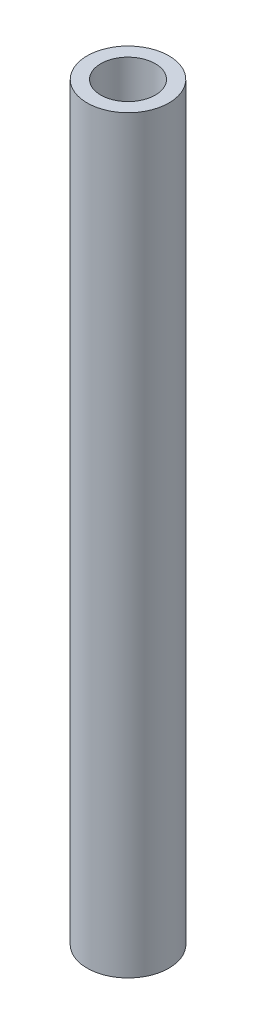
ISO-10303-21;
HEADER;
FILE_DESCRIPTION(('STEP AP214'),'2;1');
FILE_NAME('part.step','',(''),(''),'','','');
FILE_SCHEMA(('AUTOMOTIVE_DESIGN { 1 0 10303 214 1 1 1 1 }'));
ENDSEC;
DATA;
#1=APPLICATION_CONTEXT('core data for automotive mechanical design processes');
#2=APPLICATION_PROTOCOL_DEFINITION('international standard','automotive_design',2000,#1);
#3=PRODUCT_CONTEXT('',#1,'mechanical');
#4=PRODUCT('Part','Part','',(#3));
#5=PRODUCT_RELATED_PRODUCT_CATEGORY('part','',(#4));
#6=PRODUCT_DEFINITION_FORMATION('','',#4);
#7=PRODUCT_DEFINITION_CONTEXT('part definition',#1,'design');
#8=PRODUCT_DEFINITION('design','',#6,#7);
#9=PRODUCT_DEFINITION_SHAPE('','',#8);
#10=(LENGTH_UNIT() NAMED_UNIT(*) SI_UNIT(.MILLI.,.METRE.));
#11=(NAMED_UNIT(*) PLANE_ANGLE_UNIT() SI_UNIT($,.RADIAN.));
#12=(NAMED_UNIT(*) SI_UNIT($,.STERADIAN.) SOLID_ANGLE_UNIT());
#13=UNCERTAINTY_MEASURE_WITH_UNIT(LENGTH_MEASURE(1.E-05),#10,'distance_accuracy_value','');
#14=(GEOMETRIC_REPRESENTATION_CONTEXT(3) GLOBAL_UNCERTAINTY_ASSIGNED_CONTEXT((#13)) GLOBAL_UNIT_ASSIGNED_CONTEXT((#10,
#11,#12)) REPRESENTATION_CONTEXT('',''));
#15=CARTESIAN_POINT('',(0.,0.,0.));
#16=DIRECTION('',(0.,0.,1.));
#17=DIRECTION('',(1.,0.,0.));
#18=AXIS2_PLACEMENT_3D('',#15,#16,#17);
#19=CARTESIAN_POINT('',(0.,-27.5,0.));
#20=DIRECTION('',(0.,-1.,0.));
#21=DIRECTION('',(1.,0.,0.));
#22=AXIS2_PLACEMENT_3D('',#19,#20,#21);
#23=PLANE('',#22);
#24=CARTESIAN_POINT('',(0.,-27.5,0.));
#25=DIRECTION('',(0.,-1.,0.));
#26=DIRECTION('',(1.,0.,0.));
#27=AXIS2_PLACEMENT_3D('',#24,#25,#26);
#28=CIRCLE('',#27,3.00000000000001);
#29=CARTESIAN_POINT('',(3.00000000000001,-27.5,0.));
#30=VERTEX_POINT('',#29);
#31=EDGE_CURVE('E48',#30,#30,#28,.T.);
#32=ORIENTED_EDGE('',*,*,#31,.T.);
#33=EDGE_LOOP('',(#32));
#34=FACE_BOUND('',#33,.T.);
#35=CARTESIAN_POINT('',(0.,-27.5,0.));
#36=DIRECTION('',(0.,-1.,0.));
#37=DIRECTION('',(1.,0.,0.));
#38=AXIS2_PLACEMENT_3D('',#35,#36,#37);
#39=CIRCLE('',#38,2.00000000000001);
#40=CARTESIAN_POINT('',(2.00000000000001,-27.5,0.));
#41=VERTEX_POINT('',#40);
#42=EDGE_CURVE('E10',#41,#41,#39,.T.);
#43=ORIENTED_EDGE('',*,*,#42,.F.);
#44=EDGE_LOOP('',(#43));
#45=FACE_BOUND('',#44,.T.);
#46=ADVANCED_FACE('F34',(#34,#45),#23,.T.);
#47=CARTESIAN_POINT('',(0.,-0.72021608418962,0.));
#48=DIRECTION('',(0.,-1.,0.));
#49=DIRECTION('',(1.,0.,0.));
#50=AXIS2_PLACEMENT_3D('',#47,#48,#49);
#51=CYLINDRICAL_SURFACE('',#50,2.);
#52=CARTESIAN_POINT('',(0.,27.5,0.));
#53=DIRECTION('',(0.,-1.,0.));
#54=DIRECTION('',(1.,0.,0.));
#55=AXIS2_PLACEMENT_3D('',#52,#53,#54);
#56=CIRCLE('',#55,2.);
#57=CARTESIAN_POINT('',(1.99999999999999,27.5,0.));
#58=VERTEX_POINT('',#57);
#59=EDGE_CURVE('E40',#58,#58,#56,.T.);
#60=ORIENTED_EDGE('',*,*,#59,.F.);
#61=EDGE_LOOP('',(#60));
#62=FACE_BOUND('',#61,.T.);
#63=ORIENTED_EDGE('',*,*,#42,.T.);
#64=EDGE_LOOP('',(#63));
#65=FACE_BOUND('',#64,.T.);
#66=ADVANCED_FACE('F64',(#62,#65),#51,.F.);
#67=CARTESIAN_POINT('',(0.,27.5,0.));
#68=DIRECTION('',(0.,-1.,0.));
#69=DIRECTION('',(1.,0.,0.));
#70=AXIS2_PLACEMENT_3D('',#67,#68,#69);
#71=PLANE('',#70);
#72=CARTESIAN_POINT('',(0.,27.5,0.));
#73=DIRECTION('',(0.,-1.,0.));
#74=DIRECTION('',(1.,0.,0.));
#75=AXIS2_PLACEMENT_3D('',#72,#73,#74);
#76=CIRCLE('',#75,3.);
#77=CARTESIAN_POINT('',(2.99999999999999,27.5,0.));
#78=VERTEX_POINT('',#77);
#79=EDGE_CURVE('E44',#78,#78,#76,.T.);
#80=ORIENTED_EDGE('',*,*,#79,.F.);
#81=EDGE_LOOP('',(#80));
#82=FACE_BOUND('',#81,.T.);
#83=ORIENTED_EDGE('',*,*,#59,.T.);
#84=EDGE_LOOP('',(#83));
#85=FACE_BOUND('',#84,.T.);
#86=ADVANCED_FACE('F58',(#82,#85),#71,.F.);
#87=CARTESIAN_POINT('',(0.,-0.72021608418962,0.));
#88=DIRECTION('',(0.,-1.,0.));
#89=DIRECTION('',(1.,0.,0.));
#90=AXIS2_PLACEMENT_3D('',#87,#88,#89);
#91=CYLINDRICAL_SURFACE('',#90,3.);
#92=ORIENTED_EDGE('',*,*,#79,.T.);
#93=EDGE_LOOP('',(#92));
#94=FACE_BOUND('',#93,.T.);
#95=ORIENTED_EDGE('',*,*,#31,.F.);
#96=EDGE_LOOP('',(#95));
#97=FACE_BOUND('',#96,.T.);
#98=ADVANCED_FACE('F56',(#94,#97),#91,.T.);
#99=CLOSED_SHELL('',(#46,#66,#86,#98));
#100=MANIFOLD_SOLID_BREP('B2',#99);
#101=ADVANCED_BREP_SHAPE_REPRESENTATION('',(#18,#100),#14);
#102=SHAPE_DEFINITION_REPRESENTATION(#9,#101);
ENDSEC;
END-ISO-10303-21;
